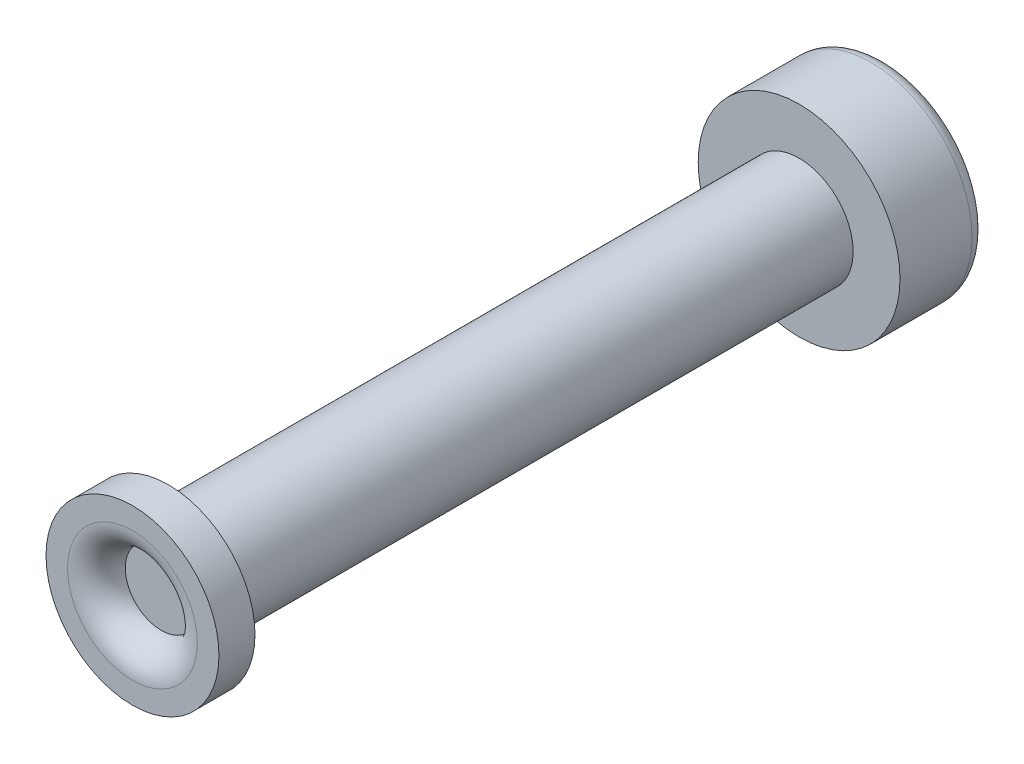
ISO-10303-21;
HEADER;
FILE_DESCRIPTION(('STEP AP214'),'2;1');
FILE_NAME('part.step','',(''),(''),'','','');
FILE_SCHEMA(('AUTOMOTIVE_DESIGN { 1 0 10303 214 1 1 1 1 }'));
ENDSEC;
DATA;
#1=APPLICATION_CONTEXT('core data for automotive mechanical design processes');
#2=APPLICATION_PROTOCOL_DEFINITION('international standard','automotive_design',2000,#1);
#3=PRODUCT_CONTEXT('',#1,'mechanical');
#4=PRODUCT('Part','Part','',(#3));
#5=PRODUCT_RELATED_PRODUCT_CATEGORY('part','',(#4));
#6=PRODUCT_DEFINITION_FORMATION('','',#4);
#7=PRODUCT_DEFINITION_CONTEXT('part definition',#1,'design');
#8=PRODUCT_DEFINITION('design','',#6,#7);
#9=PRODUCT_DEFINITION_SHAPE('','',#8);
#10=(LENGTH_UNIT() NAMED_UNIT(*) SI_UNIT(.MILLI.,.METRE.));
#11=(NAMED_UNIT(*) PLANE_ANGLE_UNIT() SI_UNIT($,.RADIAN.));
#12=(NAMED_UNIT(*) SI_UNIT($,.STERADIAN.) SOLID_ANGLE_UNIT());
#13=UNCERTAINTY_MEASURE_WITH_UNIT(LENGTH_MEASURE(1.E-05),#10,'distance_accuracy_value','');
#14=(GEOMETRIC_REPRESENTATION_CONTEXT(3) GLOBAL_UNCERTAINTY_ASSIGNED_CONTEXT((#13)) GLOBAL_UNIT_ASSIGNED_CONTEXT((#10,
#11,#12)) REPRESENTATION_CONTEXT('',''));
#15=CARTESIAN_POINT('',(0.,0.,0.));
#16=DIRECTION('',(0.,0.,1.));
#17=DIRECTION('',(1.,0.,0.));
#18=AXIS2_PLACEMENT_3D('',#15,#16,#17);
#19=CARTESIAN_POINT('',(0.,7.46,-9.75));
#20=DIRECTION('',(0.,0.,-1.));
#21=DIRECTION('',(0.,-1.,0.));
#22=AXIS2_PLACEMENT_3D('',#19,#20,#21);
#23=PLANE('',#22);
#24=CARTESIAN_POINT('',(0.,7.46,-9.75));
#25=DIRECTION('',(0.,0.,-1.));
#26=DIRECTION('',(1.,0.,0.));
#27=AXIS2_PLACEMENT_3D('',#24,#25,#26);
#28=CIRCLE('',#27,0.75);
#29=CARTESIAN_POINT('',(-0.75,7.46,-9.75));
#30=VERTEX_POINT('',#29);
#31=EDGE_CURVE('E92',#30,#30,#28,.T.);
#32=ORIENTED_EDGE('',*,*,#31,.T.);
#33=EDGE_LOOP('',(#32));
#34=FACE_BOUND('',#33,.T.);
#35=CARTESIAN_POINT('',(0.,7.46,-9.75));
#36=DIRECTION('',(0.,0.,-1.));
#37=DIRECTION('',(1.,0.,0.));
#38=AXIS2_PLACEMENT_3D('',#35,#36,#37);
#39=CIRCLE('',#38,1.4);
#40=CARTESIAN_POINT('',(-1.4,7.46,-9.75));
#41=VERTEX_POINT('',#40);
#42=EDGE_CURVE('E11',#41,#41,#39,.T.);
#43=ORIENTED_EDGE('',*,*,#42,.F.);
#44=EDGE_LOOP('',(#43));
#45=FACE_BOUND('',#44,.T.);
#46=ADVANCED_FACE('F17',(#34,#45),#23,.F.);
#47=CARTESIAN_POINT('',(0.,7.46,-10.95));
#48=DIRECTION('',(0.,0.,-1.));
#49=DIRECTION('',(0.,-1.,0.));
#50=AXIS2_PLACEMENT_3D('',#47,#48,#49);
#51=PLANE('',#50);
#52=CARTESIAN_POINT('',(0.,7.46,-10.95));
#53=DIRECTION('',(0.,0.,1.));
#54=DIRECTION('',(1.,0.,0.));
#55=AXIS2_PLACEMENT_3D('',#52,#53,#54);
#56=CIRCLE('',#55,1.2);
#57=CARTESIAN_POINT('',(1.2,7.46,-10.95));
#58=VERTEX_POINT('',#57);
#59=EDGE_CURVE('E85',#58,#58,#56,.T.);
#60=ORIENTED_EDGE('',*,*,#59,.F.);
#61=EDGE_LOOP('',(#60));
#62=FACE_BOUND('',#61,.T.);
#63=ADVANCED_FACE('F159',(#62),#51,.T.);
#64=CARTESIAN_POINT('',(0.,7.46,-9.75));
#65=DIRECTION('',(0.,0.,-1.));
#66=DIRECTION('',(1.,0.,0.));
#67=AXIS2_PLACEMENT_3D('',#64,#65,#66);
#68=CYLINDRICAL_SURFACE('',#67,1.4);
#69=CARTESIAN_POINT('',(0.,7.46,-10.75));
#70=DIRECTION('',(0.,0.,-1.));
#71=DIRECTION('',(1.,0.,0.));
#72=AXIS2_PLACEMENT_3D('',#69,#70,#71);
#73=CIRCLE('',#72,1.4);
#74=CARTESIAN_POINT('',(-1.4,7.46,-10.75));
#75=VERTEX_POINT('',#74);
#76=CARTESIAN_POINT('',(1.4,7.46,-10.75));
#77=VERTEX_POINT('',#76);
#78=EDGE_CURVE('E73',#75,#77,#73,.T.);
#79=ORIENTED_EDGE('',*,*,#78,.F.);
#80=DIRECTION('',(0.,0.,1.));
#81=VECTOR('',#80,1.);
#82=CARTESIAN_POINT('',(-1.4,7.46,-9.75));
#83=LINE('',#82,#81);
#84=EDGE_CURVE('E21',#75,#41,#83,.T.);
#85=ORIENTED_EDGE('',*,*,#84,.T.);
#86=ORIENTED_EDGE('',*,*,#42,.T.);
#87=ORIENTED_EDGE('',*,*,#84,.F.);
#88=CARTESIAN_POINT('',(0.,7.46,-10.75));
#89=DIRECTION('',(0.,0.,-1.));
#90=DIRECTION('',(1.,0.,0.));
#91=AXIS2_PLACEMENT_3D('',#88,#89,#90);
#92=CIRCLE('',#91,1.4);
#93=EDGE_CURVE('E79',#77,#75,#92,.T.);
#94=ORIENTED_EDGE('',*,*,#93,.F.);
#95=EDGE_LOOP('',(#79,#85,#86,#87,#94));
#96=FACE_BOUND('',#95,.T.);
#97=ADVANCED_FACE('F82',(#96),#68,.T.);
#98=CARTESIAN_POINT('',(0.,7.46,-10.75));
#99=DIRECTION('',(0.,0.,-1.));
#100=DIRECTION('',(-1.,0.,0.));
#101=AXIS2_PLACEMENT_3D('',#98,#99,#100);
#102=TOROIDAL_SURFACE('',#101,1.2,0.2);
#103=ORIENTED_EDGE('',*,*,#59,.T.);
#104=CARTESIAN_POINT('',(1.2,7.46,-10.75));
#105=DIRECTION('',(0.,-1.,0.));
#106=DIRECTION('',(1.,0.,0.));
#107=AXIS2_PLACEMENT_3D('',#104,#105,#106);
#108=CIRCLE('',#107,0.2);
#109=EDGE_CURVE('E78',#58,#77,#108,.T.);
#110=ORIENTED_EDGE('',*,*,#109,.T.);
#111=ORIENTED_EDGE('',*,*,#93,.T.);
#112=ORIENTED_EDGE('',*,*,#78,.T.);
#113=ORIENTED_EDGE('',*,*,#109,.F.);
#114=EDGE_LOOP('',(#103,#110,#111,#112,#113));
#115=FACE_BOUND('',#114,.T.);
#116=ADVANCED_FACE('F76',(#115),#102,.T.);
#117=CARTESIAN_POINT('',(0.,7.46,-9.75));
#118=DIRECTION('',(0.,0.,1.));
#119=DIRECTION('',(1.,0.,0.));
#120=AXIS2_PLACEMENT_3D('',#117,#118,#119);
#121=CYLINDRICAL_SURFACE('',#120,0.75);
#122=CARTESIAN_POINT('',(0.,7.46,-1.));
#123=DIRECTION('',(0.,0.,-1.));
#124=DIRECTION('',(1.,0.,0.));
#125=AXIS2_PLACEMENT_3D('',#122,#123,#124);
#126=CIRCLE('',#125,0.75);
#127=CARTESIAN_POINT('',(-0.75,7.46,-1.));
#128=VERTEX_POINT('',#127);
#129=EDGE_CURVE('E104',#128,#128,#126,.T.);
#130=ORIENTED_EDGE('',*,*,#129,.T.);
#131=DIRECTION('',(0.,0.,-1.));
#132=VECTOR('',#131,1.);
#133=CARTESIAN_POINT('',(-0.75,7.46,-9.75));
#134=LINE('',#133,#132);
#135=EDGE_CURVE('E127',#128,#30,#134,.T.);
#136=ORIENTED_EDGE('',*,*,#135,.T.);
#137=ORIENTED_EDGE('',*,*,#31,.F.);
#138=ORIENTED_EDGE('',*,*,#135,.F.);
#139=EDGE_LOOP('',(#130,#136,#137,#138));
#140=FACE_BOUND('',#139,.T.);
#141=ADVANCED_FACE('F141',(#140),#121,.T.);
#142=CARTESIAN_POINT('',(0.,7.46,-1.));
#143=DIRECTION('',(0.,0.,1.));
#144=DIRECTION('',(-1.,0.,0.));
#145=AXIS2_PLACEMENT_3D('',#142,#143,#144);
#146=CYLINDRICAL_SURFACE('',#145,1.2);
#147=CARTESIAN_POINT('',(0.,7.46,-0.5));
#148=DIRECTION('',(0.,0.,1.));
#149=DIRECTION('',(-1.,0.,0.));
#150=AXIS2_PLACEMENT_3D('',#147,#148,#149);
#151=CIRCLE('',#150,1.2);
#152=CARTESIAN_POINT('',(1.2,7.46,-0.5));
#153=VERTEX_POINT('',#152);
#154=EDGE_CURVE('E96',#153,#153,#151,.T.);
#155=ORIENTED_EDGE('',*,*,#154,.F.);
#156=DIRECTION('',(0.,0.,-1.));
#157=VECTOR('',#156,1.);
#158=CARTESIAN_POINT('',(1.2,7.46,-1.));
#159=LINE('',#158,#157);
#160=CARTESIAN_POINT('',(1.2,7.46,-1.));
#161=VERTEX_POINT('',#160);
#162=EDGE_CURVE('E108',#153,#161,#159,.T.);
#163=ORIENTED_EDGE('',*,*,#162,.T.);
#164=CARTESIAN_POINT('',(0.,7.46,-1.));
#165=DIRECTION('',(0.,0.,1.));
#166=DIRECTION('',(-1.,0.,0.));
#167=AXIS2_PLACEMENT_3D('',#164,#165,#166);
#168=CIRCLE('',#167,1.2);
#169=EDGE_CURVE('E109',#161,#161,#168,.T.);
#170=ORIENTED_EDGE('',*,*,#169,.T.);
#171=ORIENTED_EDGE('',*,*,#162,.F.);
#172=EDGE_LOOP('',(#155,#163,#170,#171));
#173=FACE_BOUND('',#172,.T.);
#174=ADVANCED_FACE('F124',(#173),#146,.T.);
#175=CARTESIAN_POINT('',(0.,7.46,-1.));
#176=DIRECTION('',(0.,0.,1.));
#177=DIRECTION('',(1.,0.,0.));
#178=AXIS2_PLACEMENT_3D('',#175,#176,#177);
#179=PLANE('',#178);
#180=ORIENTED_EDGE('',*,*,#129,.F.);
#181=EDGE_LOOP('',(#180));
#182=FACE_BOUND('',#181,.T.);
#183=ORIENTED_EDGE('',*,*,#169,.F.);
#184=EDGE_LOOP('',(#183));
#185=FACE_BOUND('',#184,.T.);
#186=ADVANCED_FACE('F144',(#182,#185),#179,.F.);
#187=CARTESIAN_POINT('',(0.,7.46,-0.9));
#188=DIRECTION('',(0.,0.,1.));
#189=DIRECTION('',(1.,0.,0.));
#190=AXIS2_PLACEMENT_3D('',#187,#188,#189);
#191=PLANE('',#190);
#192=CARTESIAN_POINT('',(0.,7.46,-0.9));
#193=DIRECTION('',(0.,0.,-1.));
#194=DIRECTION('',(-1.,0.,0.));
#195=AXIS2_PLACEMENT_3D('',#192,#193,#194);
#196=CIRCLE('',#195,0.5);
#197=CARTESIAN_POINT('',(0.5,7.46,-0.9));
#198=VERTEX_POINT('',#197);
#199=EDGE_CURVE('E102',#198,#198,#196,.T.);
#200=ORIENTED_EDGE('',*,*,#199,.F.);
#201=EDGE_LOOP('',(#200));
#202=FACE_BOUND('',#201,.T.);
#203=ADVANCED_FACE('F147',(#202),#191,.T.);
#204=CARTESIAN_POINT('',(0.,7.46,-0.5));
#205=DIRECTION('',(0.,0.,1.));
#206=DIRECTION('',(1.,0.,0.));
#207=AXIS2_PLACEMENT_3D('',#204,#205,#206);
#208=PLANE('',#207);
#209=CARTESIAN_POINT('',(0.,7.46,-0.5));
#210=DIRECTION('',(0.,0.,1.));
#211=DIRECTION('',(-1.,0.,0.));
#212=AXIS2_PLACEMENT_3D('',#209,#210,#211);
#213=CIRCLE('',#212,0.9);
#214=CARTESIAN_POINT('',(0.9,7.46,-0.5));
#215=VERTEX_POINT('',#214);
#216=EDGE_CURVE('E103',#215,#215,#213,.T.);
#217=ORIENTED_EDGE('',*,*,#216,.F.);
#218=EDGE_LOOP('',(#217));
#219=FACE_BOUND('',#218,.T.);
#220=ORIENTED_EDGE('',*,*,#154,.T.);
#221=EDGE_LOOP('',(#220));
#222=FACE_BOUND('',#221,.T.);
#223=ADVANCED_FACE('F122',(#219,#222),#208,.T.);
#224=CARTESIAN_POINT('',(0.,7.46,-0.9));
#225=DIRECTION('',(0.,0.,-1.));
#226=DIRECTION('',(-1.,0.,0.));
#227=AXIS2_PLACEMENT_3D('',#224,#225,#226);
#228=TOROIDAL_SURFACE('',#227,0.9,0.4);
#229=ORIENTED_EDGE('',*,*,#216,.T.);
#230=CARTESIAN_POINT('',(0.9,7.46,-0.9));
#231=DIRECTION('',(0.,-1.,0.));
#232=DIRECTION('',(1.,0.,0.));
#233=AXIS2_PLACEMENT_3D('',#230,#231,#232);
#234=CIRCLE('',#233,0.4);
#235=EDGE_CURVE('E98',#215,#198,#234,.T.);
#236=ORIENTED_EDGE('',*,*,#235,.T.);
#237=ORIENTED_EDGE('',*,*,#199,.T.);
#238=ORIENTED_EDGE('',*,*,#235,.F.);
#239=EDGE_LOOP('',(#229,#236,#237,#238));
#240=FACE_BOUND('',#239,.T.);
#241=ADVANCED_FACE('F19',(#240),#228,.T.);
#242=CLOSED_SHELL('',(#46,#63,#97,#116,#141,#174,#186,#203,#223,#241));
#243=MANIFOLD_SOLID_BREP('B1',#242);
#244=ADVANCED_BREP_SHAPE_REPRESENTATION('',(#18,#243),#14);
#245=SHAPE_DEFINITION_REPRESENTATION(#9,#244);
ENDSEC;
END-ISO-10303-21;
